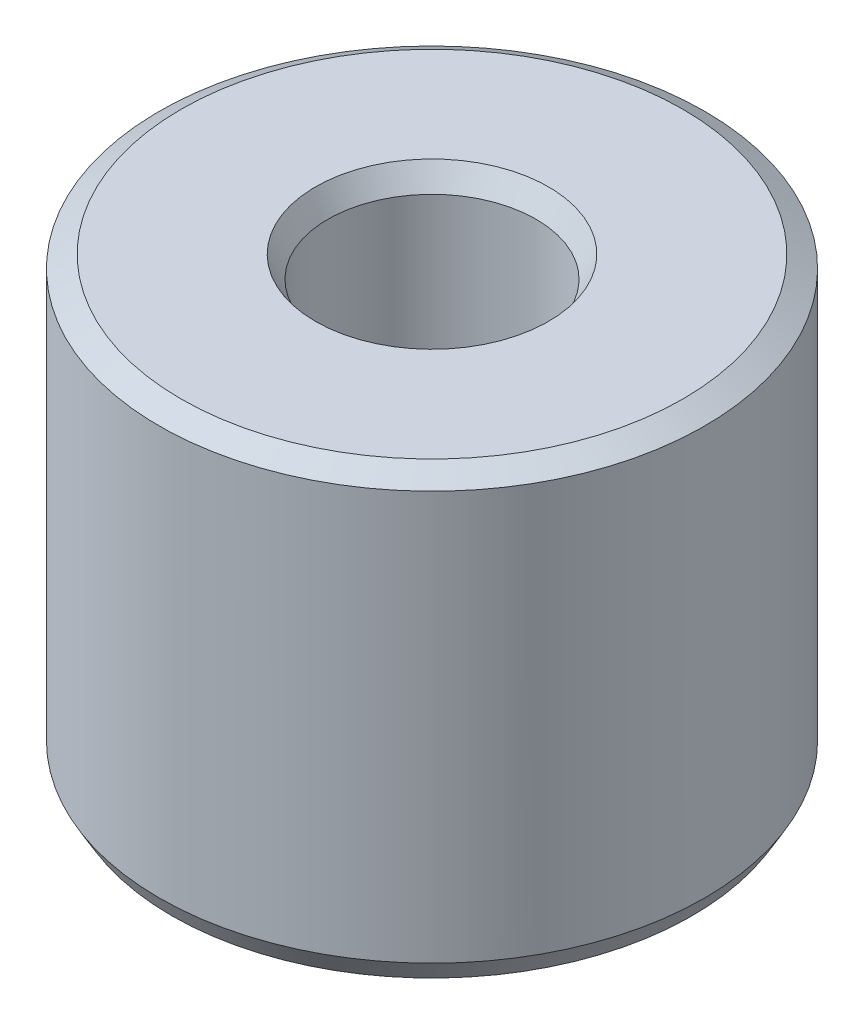
ISO-10303-21;
HEADER;
FILE_DESCRIPTION(('STEP AP214'),'2;1');
FILE_NAME('part.step','',(''),(''),'','','');
FILE_SCHEMA(('AUTOMOTIVE_DESIGN { 1 0 10303 214 1 1 1 1 }'));
ENDSEC;
DATA;
#1=APPLICATION_CONTEXT('core data for automotive mechanical design processes');
#2=APPLICATION_PROTOCOL_DEFINITION('international standard','automotive_design',2000,#1);
#3=PRODUCT_CONTEXT('',#1,'mechanical');
#4=PRODUCT('Part','Part','',(#3));
#5=PRODUCT_RELATED_PRODUCT_CATEGORY('part','',(#4));
#6=PRODUCT_DEFINITION_FORMATION('','',#4);
#7=PRODUCT_DEFINITION_CONTEXT('part definition',#1,'design');
#8=PRODUCT_DEFINITION('design','',#6,#7);
#9=PRODUCT_DEFINITION_SHAPE('','',#8);
#10=(LENGTH_UNIT() NAMED_UNIT(*) SI_UNIT(.MILLI.,.METRE.));
#11=(NAMED_UNIT(*) PLANE_ANGLE_UNIT() SI_UNIT($,.RADIAN.));
#12=(NAMED_UNIT(*) SI_UNIT($,.STERADIAN.) SOLID_ANGLE_UNIT());
#13=UNCERTAINTY_MEASURE_WITH_UNIT(LENGTH_MEASURE(1.E-05),#10,'distance_accuracy_value','');
#14=(GEOMETRIC_REPRESENTATION_CONTEXT(3) GLOBAL_UNCERTAINTY_ASSIGNED_CONTEXT((#13)) GLOBAL_UNIT_ASSIGNED_CONTEXT((#10,
#11,#12)) REPRESENTATION_CONTEXT('',''));
#15=CARTESIAN_POINT('',(0.,0.,0.));
#16=DIRECTION('',(0.,0.,1.));
#17=DIRECTION('',(1.,0.,0.));
#18=AXIS2_PLACEMENT_3D('',#15,#16,#17);
#19=CARTESIAN_POINT('',(0.,48.7459401507615,0.));
#20=DIRECTION('',(0.,-1.,0.));
#21=DIRECTION('',(0.,0.,-1.));
#22=AXIS2_PLACEMENT_3D('',#19,#20,#21);
#23=CYLINDRICAL_SURFACE('',#22,30.);
#24=CARTESIAN_POINT('',(0.,2.39023846659622,0.));
#25=DIRECTION('',(0.,1.,0.));
#26=DIRECTION('',(0.,0.,1.));
#27=AXIS2_PLACEMENT_3D('',#24,#25,#26);
#28=CIRCLE('',#27,30.);
#29=CARTESIAN_POINT('',(0.,2.39023846659622,30.));
#30=VERTEX_POINT('',#29);
#31=EDGE_CURVE('E10',#30,#30,#28,.T.);
#32=ORIENTED_EDGE('',*,*,#31,.T.);
#33=EDGE_LOOP('',(#32));
#34=FACE_BOUND('',#33,.T.);
#35=CARTESIAN_POINT('',(0.,47.3659353286448,0.));
#36=DIRECTION('',(0.,1.,0.));
#37=DIRECTION('',(0.,0.,1.));
#38=AXIS2_PLACEMENT_3D('',#35,#36,#37);
#39=CIRCLE('',#38,30.);
#40=CARTESIAN_POINT('',(0.,47.3659353286448,-30.));
#41=VERTEX_POINT('',#40);
#42=EDGE_CURVE('E50',#41,#41,#39,.F.);
#43=ORIENTED_EDGE('',*,*,#42,.T.);
#44=EDGE_LOOP('',(#43));
#45=FACE_BOUND('',#44,.T.);
#46=ADVANCED_FACE('F39',(#34,#45),#23,.T.);
#47=CARTESIAN_POINT('',(0.,48.7459401507615,0.));
#48=DIRECTION('',(0.,1.,0.));
#49=DIRECTION('',(0.,0.,1.));
#50=AXIS2_PLACEMENT_3D('',#47,#48,#49);
#51=PLANE('',#50);
#52=CARTESIAN_POINT('',(0.,48.7459401507615,0.));
#53=DIRECTION('',(0.,1.,0.));
#54=DIRECTION('',(0.,0.,1.));
#55=AXIS2_PLACEMENT_3D('',#52,#53,#54);
#56=CIRCLE('',#55,12.8252857116636);
#57=CARTESIAN_POINT('',(0.,48.7459401507615,12.8252857116636));
#58=VERTEX_POINT('',#57);
#59=EDGE_CURVE('E58',#58,#58,#56,.F.);
#60=ORIENTED_EDGE('',*,*,#59,.T.);
#61=EDGE_LOOP('',(#60));
#62=FACE_BOUND('',#61,.T.);
#63=CARTESIAN_POINT('',(0.,48.7459401507615,0.));
#64=DIRECTION('',(0.,1.,0.));
#65=DIRECTION('',(0.,0.,1.));
#66=AXIS2_PLACEMENT_3D('',#63,#64,#65);
#67=CIRCLE('',#66,27.6097615334038);
#68=CARTESIAN_POINT('',(0.,48.7459401507615,-27.6097615334038));
#69=VERTEX_POINT('',#68);
#70=EDGE_CURVE('E61',#69,#69,#67,.T.);
#71=ORIENTED_EDGE('',*,*,#70,.T.);
#72=EDGE_LOOP('',(#71));
#73=FACE_BOUND('',#72,.T.);
#74=ADVANCED_FACE('F88',(#62,#73),#51,.T.);
#75=CARTESIAN_POINT('',(0.,0.,0.));
#76=DIRECTION('',(0.,1.,0.));
#77=DIRECTION('',(0.,0.,1.));
#78=AXIS2_PLACEMENT_3D('',#75,#76,#77);
#79=PLANE('',#78);
#80=CARTESIAN_POINT('',(0.,0.,0.));
#81=DIRECTION('',(0.,1.,0.));
#82=DIRECTION('',(0.,0.,1.));
#83=AXIS2_PLACEMENT_3D('',#80,#81,#82);
#84=CIRCLE('',#83,13.8355193561431);
#85=CARTESIAN_POINT('',(0.,0.,-13.8355193561431));
#86=VERTEX_POINT('',#85);
#87=EDGE_CURVE('E51',#86,#86,#84,.T.);
#88=ORIENTED_EDGE('',*,*,#87,.T.);
#89=EDGE_LOOP('',(#88));
#90=FACE_BOUND('',#89,.T.);
#91=CARTESIAN_POINT('',(0.,0.,0.));
#92=DIRECTION('',(0.,1.,0.));
#93=DIRECTION('',(0.,0.,1.));
#94=AXIS2_PLACEMENT_3D('',#91,#92,#93);
#95=CIRCLE('',#94,28.6199951778833);
#96=CARTESIAN_POINT('',(0.,0.,28.6199951778833));
#97=VERTEX_POINT('',#96);
#98=EDGE_CURVE('E54',#97,#97,#95,.F.);
#99=ORIENTED_EDGE('',*,*,#98,.T.);
#100=EDGE_LOOP('',(#99));
#101=FACE_BOUND('',#100,.T.);
#102=ADVANCED_FACE('F83',(#90,#101),#79,.F.);
#103=CARTESIAN_POINT('',(0.,48.7459401507615,0.));
#104=DIRECTION('',(0.,-1.,0.));
#105=DIRECTION('',(0.,0.,-1.));
#106=AXIS2_PLACEMENT_3D('',#103,#104,#105);
#107=CYLINDRICAL_SURFACE('',#106,11.4452808895469);
#108=CARTESIAN_POINT('',(0.,46.3557016841653,0.));
#109=DIRECTION('',(0.,1.,0.));
#110=DIRECTION('',(0.,0.,1.));
#111=AXIS2_PLACEMENT_3D('',#108,#109,#110);
#112=CIRCLE('',#111,11.4452808895469);
#113=CARTESIAN_POINT('',(0.,46.3557016841653,11.4452808895469));
#114=VERTEX_POINT('',#113);
#115=EDGE_CURVE('E67',#114,#114,#112,.T.);
#116=ORIENTED_EDGE('',*,*,#115,.T.);
#117=EDGE_LOOP('',(#116));
#118=FACE_BOUND('',#117,.T.);
#119=CARTESIAN_POINT('',(0.,1.38000482211675,0.));
#120=DIRECTION('',(0.,1.,0.));
#121=DIRECTION('',(0.,0.,1.));
#122=AXIS2_PLACEMENT_3D('',#119,#120,#121);
#123=CIRCLE('',#122,11.4452808895469);
#124=CARTESIAN_POINT('',(0.,1.38000482211675,-11.4452808895469));
#125=VERTEX_POINT('',#124);
#126=EDGE_CURVE('E69',#125,#125,#123,.F.);
#127=ORIENTED_EDGE('',*,*,#126,.T.);
#128=EDGE_LOOP('',(#127));
#129=FACE_BOUND('',#128,.T.);
#130=ADVANCED_FACE('F71',(#118,#129),#107,.F.);
#131=CARTESIAN_POINT('',(0.,46.3557016841653,0.));
#132=DIRECTION('',(0.,1.,0.));
#133=DIRECTION('',(0.,0.,1.));
#134=AXIS2_PLACEMENT_3D('',#131,#132,#133);
#135=CONICAL_SURFACE('',#134,11.4452808895469,0.523598775598303);
#136=ORIENTED_EDGE('',*,*,#59,.F.);
#137=EDGE_LOOP('',(#136));
#138=FACE_BOUND('',#137,.T.);
#139=ORIENTED_EDGE('',*,*,#115,.F.);
#140=EDGE_LOOP('',(#139));
#141=FACE_BOUND('',#140,.T.);
#142=ADVANCED_FACE('F77',(#138,#141),#135,.F.);
#143=CARTESIAN_POINT('',(0.,0.,0.));
#144=DIRECTION('',(0.,-1.,0.));
#145=DIRECTION('',(0.,0.,-1.));
#146=AXIS2_PLACEMENT_3D('',#143,#144,#145);
#147=CONICAL_SURFACE('',#146,13.8355193561431,1.0471975511966);
#148=CARTESIAN_POINT('',(0.,1.38000482211675,-11.4452808895469));
#149=CARTESIAN_POINT('',(0.,1.36562977188637,-11.4701792069073));
#150=CARTESIAN_POINT('',(0.,1.35125472165599,-11.4950775242676));
#151=CARTESIAN_POINT('',(0.,1.32250462119522,-11.5448741589884));
#152=CARTESIAN_POINT('',(0.,1.30812957096484,-11.5697724763488));
#153=CARTESIAN_POINT('',(0.,1.27937947050407,-11.6195691110695));
#154=CARTESIAN_POINT('',(0.,1.26500442027369,-11.6444674284299));
#155=CARTESIAN_POINT('',(0.,1.23625431981292,-11.6942640631507));
#156=CARTESIAN_POINT('',(0.,1.22187926958254,-11.719162380511));
#157=CARTESIAN_POINT('',(0.,1.19312916912178,-11.7689590152318));
#158=CARTESIAN_POINT('',(0.,1.17875411889139,-11.7938573325922));
#159=CARTESIAN_POINT('',(0.,1.15000401843063,-11.8436539673129));
#160=CARTESIAN_POINT('',(0.,1.13562896820025,-11.8685522846733));
#161=CARTESIAN_POINT('',(0.,1.10687886773948,-11.9183489193941));
#162=CARTESIAN_POINT('',(0.,1.0925038175091,-11.9432472367544));
#163=CARTESIAN_POINT('',(0.,1.06375371704833,-11.9930438714752));
#164=CARTESIAN_POINT('',(0.,1.04937866681795,-12.0179421888356));
#165=CARTESIAN_POINT('',(0.,1.02062856635718,-12.0677388235563));
#166=CARTESIAN_POINT('',(0.,1.0062535161268,-12.0926371409167));
#167=CARTESIAN_POINT('',(0.,0.977503415666034,-12.1424337756375));
#168=CARTESIAN_POINT('',(0.,0.963128365435651,-12.1673320929978));
#169=CARTESIAN_POINT('',(0.,0.934378264974885,-12.2171287277186));
#170=CARTESIAN_POINT('',(0.,0.920003214744502,-12.242027045079));
#171=CARTESIAN_POINT('',(0.,0.891253114283737,-12.2918236797997));
#172=CARTESIAN_POINT('',(0.,0.876878064053354,-12.3167219971601));
#173=CARTESIAN_POINT('',(0.,0.848127963592588,-12.3665186318809));
#174=CARTESIAN_POINT('',(0.,0.833752913362205,-12.3914169492412));
#175=CARTESIAN_POINT('',(0.,0.80500281290144,-12.441213583962));
#176=CARTESIAN_POINT('',(0.,0.790627762671057,-12.4661119013224));
#177=CARTESIAN_POINT('',(0.,0.761877662210291,-12.5159085360431));
#178=CARTESIAN_POINT('',(0.,0.747502611979908,-12.5408068534035));
#179=CARTESIAN_POINT('',(0.,0.718752511519142,-12.5906034881243));
#180=CARTESIAN_POINT('',(0.,0.70437746128876,-12.6155018054846));
#181=CARTESIAN_POINT('',(0.,0.675627360827994,-12.6652984402054));
#182=CARTESIAN_POINT('',(0.,0.661252310597611,-12.6901967575658));
#183=CARTESIAN_POINT('',(0.,0.632502210136845,-12.7399933922865));
#184=CARTESIAN_POINT('',(0.,0.618127159906462,-12.7648917096469));
#185=CARTESIAN_POINT('',(0.,0.589377059445697,-12.8146883443677));
#186=CARTESIAN_POINT('',(0.,0.575002009215314,-12.839586661728));
#187=CARTESIAN_POINT('',(0.,0.546251908754548,-12.8893832964488));
#188=CARTESIAN_POINT('',(0.,0.531876858524166,-12.9142816138092));
#189=CARTESIAN_POINT('',(0.,0.5031267580634,-12.9640782485299));
#190=CARTESIAN_POINT('',(0.,0.488751707833017,-12.9889765658903));
#191=CARTESIAN_POINT('',(0.,0.460001607372251,-13.0387732006111));
#192=CARTESIAN_POINT('',(0.,0.445626557141868,-13.0636715179714));
#193=CARTESIAN_POINT('',(0.,0.416876456681103,-13.1134681526922));
#194=CARTESIAN_POINT('',(0.,0.40250140645072,-13.1383664700526));
#195=CARTESIAN_POINT('',(0.,0.373751305989954,-13.1881631047733));
#196=CARTESIAN_POINT('',(0.,0.359376255759571,-13.2130614221337));
#197=CARTESIAN_POINT('',(0.,0.330626155298806,-13.2628580568545));
#198=CARTESIAN_POINT('',(0.,0.316251105068423,-13.2877563742148));
#199=CARTESIAN_POINT('',(0.,0.287501004607657,-13.3375530089356));
#200=CARTESIAN_POINT('',(0.,0.273125954377274,-13.362451326296));
#201=CARTESIAN_POINT('',(0.,0.244375853916508,-13.4122479610167));
#202=CARTESIAN_POINT('',(0.,0.230000803686126,-13.4371462783771));
#203=CARTESIAN_POINT('',(0.,0.20125070322536,-13.4869429130979));
#204=CARTESIAN_POINT('',(0.,0.186875652994977,-13.5118412304582));
#205=CARTESIAN_POINT('',(0.,0.158125552534211,-13.561637865179));
#206=CARTESIAN_POINT('',(0.,0.143750502303829,-13.5865361825394));
#207=CARTESIAN_POINT('',(0.,0.115000401843063,-13.6363328172601));
#208=CARTESIAN_POINT('',(0.,0.10062535161268,-13.6612311346205));
#209=CARTESIAN_POINT('',(0.,0.0718752511519141,-13.7110277693413));
#210=CARTESIAN_POINT('',(0.,0.0575002009215314,-13.7359260867016));
#211=CARTESIAN_POINT('',(0.,0.028750100460766,-13.7857227214224));
#212=CARTESIAN_POINT('',(0.,0.0143750502303832,-13.8106210387828));
#213=CARTESIAN_POINT('',(0.,0.,-13.8355193561431));
#214=B_SPLINE_CURVE_WITH_KNOTS('',3,(#148,#149,#150,#151,#152,#153,#154,#155,#156,#157,#158,
#159,#160,#161,#162,#163,#164,#165,#166,#167,#168,#169,#170,#171,#172,#173,#174,#175,#176,#177,
#178,#179,#180,#181,#182,#183,#184,#185,#186,#187,#188,#189,#190,#191,#192,#193,#194,#195,#196,
#197,#198,#199,#200,#201,#202,#203,#204,#205,#206,#207,#208,#209,#210,#211,#212,#213),
.UNSPECIFIED.,.F.,.F.,(4,2,2,2,2,2,2,2,2,2,2,2,2,2,2,2,2,2,2,2,2,2,2,2,2,2,2,2,2,2,2,2,4),(0.,
0.0862503013822966,0.172500602764595,0.258750904146891,0.345001205529188,0.431251506911485,
0.517501808293783,0.60375210967608,0.690002411058376,0.776252712440674,0.862503013822971,
0.948753315205268,1.03500361658756,1.12125391796986,1.20750421935216,1.29375452073446,
1.38000482211675,1.46625512349905,1.55250542488135,1.63875572626364,1.72500602764594,
1.81125632902824,1.89750663041054,1.98375693179283,2.07000723317513,2.15625753455743,
2.24250783593972,2.32875813732202,2.41500843870432,2.50125874008661,2.58750904146891,
2.67375934285121,2.76000964423351),.UNSPECIFIED.);
#215=EDGE_CURVE('BSEAM73',#125,#86,#214,.T.);
#216=ORIENTED_EDGE('',*,*,#126,.F.);
#217=ORIENTED_EDGE('',*,*,#87,.F.);
#218=ORIENTED_EDGE('',*,*,#215,.T.);
#219=ORIENTED_EDGE('',*,*,#215,.F.);
#220=EDGE_LOOP('',(#216,#218,#217,#219));
#221=FACE_BOUND('',#220,.T.);
#222=ADVANCED_FACE('F73',(#221),#147,.F.);
#223=CARTESIAN_POINT('',(0.,2.39023846659622,0.));
#224=DIRECTION('',(0.,1.,0.));
#225=DIRECTION('',(0.,0.,1.));
#226=AXIS2_PLACEMENT_3D('',#223,#224,#225);
#227=CONICAL_SURFACE('',#226,30.,0.523598775598302);
#228=ORIENTED_EDGE('',*,*,#98,.F.);
#229=EDGE_LOOP('',(#228));
#230=FACE_BOUND('',#229,.T.);
#231=ORIENTED_EDGE('',*,*,#31,.F.);
#232=EDGE_LOOP('',(#231));
#233=FACE_BOUND('',#232,.T.);
#234=ADVANCED_FACE('F76',(#230,#233),#227,.T.);
#235=CARTESIAN_POINT('',(0.,48.7459401507615,0.));
#236=DIRECTION('',(0.,-1.,0.));
#237=DIRECTION('',(0.,0.,-1.));
#238=AXIS2_PLACEMENT_3D('',#235,#236,#237);
#239=CONICAL_SURFACE('',#238,27.6097615334038,1.0471975511966);
#240=CARTESIAN_POINT('',(0.,47.3659353286448,-30.));
#241=CARTESIAN_POINT('',(0.,47.3803103788751,-29.9751016826396));
#242=CARTESIAN_POINT('',(0.,47.3946854291055,-29.9502033652793));
#243=CARTESIAN_POINT('',(0.,47.4234355295663,-29.9004067305585));
#244=CARTESIAN_POINT('',(0.,47.4378105797967,-29.8755084131981));
#245=CARTESIAN_POINT('',(0.,47.4665606802574,-29.8257117784774));
#246=CARTESIAN_POINT('',(0.,47.4809357304878,-29.800813461117));
#247=CARTESIAN_POINT('',(0.,47.5096858309486,-29.7510168263962));
#248=CARTESIAN_POINT('',(0.,47.524060881179,-29.7261185090358));
#249=CARTESIAN_POINT('',(0.,47.5528109816397,-29.6763218743151));
#250=CARTESIAN_POINT('',(0.,47.5671860318701,-29.6514235569547));
#251=CARTESIAN_POINT('',(0.,47.5959361323309,-29.601626922234));
#252=CARTESIAN_POINT('',(0.,47.6103111825613,-29.5767286048736));
#253=CARTESIAN_POINT('',(0.,47.639061283022,-29.5269319701528));
#254=CARTESIAN_POINT('',(0.,47.6534363332524,-29.5020336527925));
#255=CARTESIAN_POINT('',(0.,47.6821864337132,-29.4522370180717));
#256=CARTESIAN_POINT('',(0.,47.6965614839436,-29.4273387007113));
#257=CARTESIAN_POINT('',(0.,47.7253115844043,-29.3775420659906));
#258=CARTESIAN_POINT('',(0.,47.7396866346347,-29.3526437486302));
#259=CARTESIAN_POINT('',(0.,47.7684367350955,-29.3028471139094));
#260=CARTESIAN_POINT('',(0.,47.7828117853259,-29.2779487965491));
#261=CARTESIAN_POINT('',(0.,47.8115618857866,-29.2281521618283));
#262=CARTESIAN_POINT('',(0.,47.825936936017,-29.2032538444679));
#263=CARTESIAN_POINT('',(0.,47.8546870364778,-29.1534572097472));
#264=CARTESIAN_POINT('',(0.,47.8690620867082,-29.1285588923868));
#265=CARTESIAN_POINT('',(0.,47.8978121871689,-29.078762257666));
#266=CARTESIAN_POINT('',(0.,47.9121872373993,-29.0538639403057));
#267=CARTESIAN_POINT('',(0.,47.9409373378601,-29.0040673055849));
#268=CARTESIAN_POINT('',(0.,47.9553123880905,-28.9791689882245));
#269=CARTESIAN_POINT('',(0.,47.9840624885512,-28.9293723535038));
#270=CARTESIAN_POINT('',(0.,47.9984375387816,-28.9044740361434));
#271=CARTESIAN_POINT('',(0.,48.0271876392424,-28.8546774014226));
#272=CARTESIAN_POINT('',(0.,48.0415626894728,-28.8297790840623));
#273=CARTESIAN_POINT('',(0.,48.0703127899335,-28.7799824493415));
#274=CARTESIAN_POINT('',(0.,48.0846878401639,-28.7550841319811));
#275=CARTESIAN_POINT('',(0.,48.1134379406247,-28.7052874972604));
#276=CARTESIAN_POINT('',(0.,48.127812990855,-28.6803891799));
#277=CARTESIAN_POINT('',(0.,48.1565630913158,-28.6305925451792));
#278=CARTESIAN_POINT('',(0.,48.1709381415462,-28.6056942278189));
#279=CARTESIAN_POINT('',(0.,48.199688242007,-28.5558975930981));
#280=CARTESIAN_POINT('',(0.,48.2140632922373,-28.5309992757377));
#281=CARTESIAN_POINT('',(0.,48.2428133926981,-28.481202641017));
#282=CARTESIAN_POINT('',(0.,48.2571884429285,-28.4563043236566));
#283=CARTESIAN_POINT('',(0.,48.2859385433893,-28.4065076889358));
#284=CARTESIAN_POINT('',(0.,48.3003135936196,-28.3816093715755));
#285=CARTESIAN_POINT('',(0.,48.3290636940804,-28.3318127368547));
#286=CARTESIAN_POINT('',(0.,48.3434387443108,-28.3069144194943));
#287=CARTESIAN_POINT('',(0.,48.3721888447716,-28.2571177847736));
#288=CARTESIAN_POINT('',(0.,48.3865638950019,-28.2322194674132));
#289=CARTESIAN_POINT('',(0.,48.4153139954627,-28.1824228326924));
#290=CARTESIAN_POINT('',(0.,48.4296890456931,-28.1575245153321));
#291=CARTESIAN_POINT('',(0.,48.4584391461539,-28.1077278806113));
#292=CARTESIAN_POINT('',(0.,48.4728141963842,-28.0828295632509));
#293=CARTESIAN_POINT('',(0.,48.501564296845,-28.0330329285302));
#294=CARTESIAN_POINT('',(0.,48.5159393470754,-28.0081346111698));
#295=CARTESIAN_POINT('',(0.,48.5446894475362,-27.958337976449));
#296=CARTESIAN_POINT('',(0.,48.5590644977665,-27.9334396590887));
#297=CARTESIAN_POINT('',(0.,48.5878145982273,-27.8836430243679));
#298=CARTESIAN_POINT('',(0.,48.6021896484577,-27.8587447070075));
#299=CARTESIAN_POINT('',(0.,48.6309397489184,-27.8089480722868));
#300=CARTESIAN_POINT('',(0.,48.6453147991488,-27.7840497549264));
#301=CARTESIAN_POINT('',(0.,48.6740648996096,-27.7342531202056));
#302=CARTESIAN_POINT('',(0.,48.68843994984,-27.7093548028453));
#303=CARTESIAN_POINT('',(0.,48.7171900503007,-27.6595581681245));
#304=CARTESIAN_POINT('',(0.,48.7315651005311,-27.6346598507641));
#305=CARTESIAN_POINT('',(0.,48.7459401507615,-27.6097615334038));
#306=B_SPLINE_CURVE_WITH_KNOTS('',3,(#240,#241,#242,#243,#244,#245,#246,#247,#248,#249,#250,
#251,#252,#253,#254,#255,#256,#257,#258,#259,#260,#261,#262,#263,#264,#265,#266,#267,#268,#269,
#270,#271,#272,#273,#274,#275,#276,#277,#278,#279,#280,#281,#282,#283,#284,#285,#286,#287,#288,
#289,#290,#291,#292,#293,#294,#295,#296,#297,#298,#299,#300,#301,#302,#303,#304,#305),
.UNSPECIFIED.,.F.,.F.,(4,2,2,2,2,2,2,2,2,2,2,2,2,2,2,2,2,2,2,2,2,2,2,2,2,2,2,2,2,2,2,2,4),(0.,
0.0862503013822984,0.172500602764593,0.258750904146892,0.345001205529187,0.431251506911485,
0.51750180829378,0.603752109676078,0.690002411058373,0.776252712440671,0.862503013822966,
0.948753315205265,1.03500361658756,1.12125391796986,1.20750421935215,1.29375452073445,
1.38000482211675,1.46625512349904,1.55250542488134,1.63875572626363,1.72500602764593,
1.81125632902823,1.89750663041053,1.98375693179282,2.07000723317512,2.15625753455741,
2.24250783593971,2.328758137322,2.4150084387043,2.5012587400866,2.5875090414689,
2.67375934285119,2.76000964423349),.UNSPECIFIED.);
#307=EDGE_CURVE('BSEAM45',#41,#69,#306,.T.);
#308=ORIENTED_EDGE('',*,*,#42,.F.);
#309=ORIENTED_EDGE('',*,*,#70,.F.);
#310=ORIENTED_EDGE('',*,*,#307,.T.);
#311=ORIENTED_EDGE('',*,*,#307,.F.);
#312=EDGE_LOOP('',(#308,#310,#309,#311));
#313=FACE_BOUND('',#312,.T.);
#314=ADVANCED_FACE('F45',(#313),#239,.T.);
#315=CLOSED_SHELL('',(#46,#74,#102,#130,#142,#222,#234,#314));
#316=MANIFOLD_SOLID_BREP('B2',#315);
#317=ADVANCED_BREP_SHAPE_REPRESENTATION('',(#18,#316),#14);
#318=SHAPE_DEFINITION_REPRESENTATION(#9,#317);
ENDSEC;
END-ISO-10303-21;
